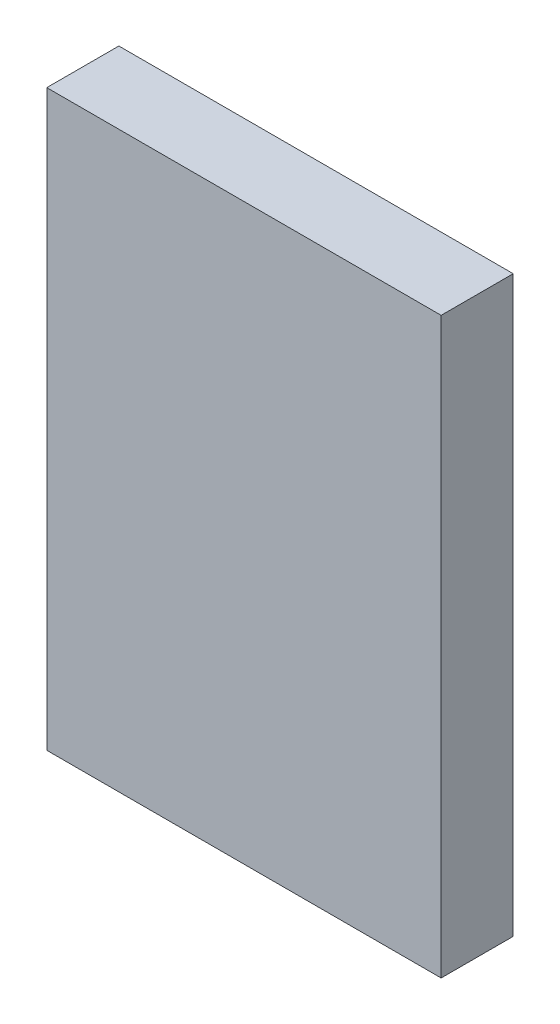
ISO-10303-21;
HEADER;
FILE_DESCRIPTION(('STEP AP214'),'2;1');
FILE_NAME('part.step','',(''),(''),'','','');
FILE_SCHEMA(('AUTOMOTIVE_DESIGN { 1 0 10303 214 1 1 1 1 }'));
ENDSEC;
DATA;
#1=APPLICATION_CONTEXT('core data for automotive mechanical design processes');
#2=APPLICATION_PROTOCOL_DEFINITION('international standard','automotive_design',2000,#1);
#3=PRODUCT_CONTEXT('',#1,'mechanical');
#4=PRODUCT('Part','Part','',(#3));
#5=PRODUCT_RELATED_PRODUCT_CATEGORY('part','',(#4));
#6=PRODUCT_DEFINITION_FORMATION('','',#4);
#7=PRODUCT_DEFINITION_CONTEXT('part definition',#1,'design');
#8=PRODUCT_DEFINITION('design','',#6,#7);
#9=PRODUCT_DEFINITION_SHAPE('','',#8);
#10=(LENGTH_UNIT() NAMED_UNIT(*) SI_UNIT(.MILLI.,.METRE.));
#11=(NAMED_UNIT(*) PLANE_ANGLE_UNIT() SI_UNIT($,.RADIAN.));
#12=(NAMED_UNIT(*) SI_UNIT($,.STERADIAN.) SOLID_ANGLE_UNIT());
#13=UNCERTAINTY_MEASURE_WITH_UNIT(LENGTH_MEASURE(1.E-05),#10,'distance_accuracy_value','');
#14=(GEOMETRIC_REPRESENTATION_CONTEXT(3) GLOBAL_UNCERTAINTY_ASSIGNED_CONTEXT((#13)) GLOBAL_UNIT_ASSIGNED_CONTEXT((#10,
#11,#12)) REPRESENTATION_CONTEXT('',''));
#15=CARTESIAN_POINT('',(0.,0.,0.));
#16=DIRECTION('',(0.,0.,1.));
#17=DIRECTION('',(1.,0.,0.));
#18=AXIS2_PLACEMENT_3D('',#15,#16,#17);
#19=CARTESIAN_POINT('',(-1.054,1.143,0.));
#20=DIRECTION('',(0.,-1.,0.));
#21=DIRECTION('',(0.,0.,-1.));
#22=AXIS2_PLACEMENT_3D('',#19,#20,#21);
#23=PLANE('',#22);
#24=DIRECTION('',(-1.,0.,0.));
#25=VECTOR('',#24,1.);
#26=CARTESIAN_POINT('',(-0.775,1.143,0.));
#27=LINE('',#26,#25);
#28=CARTESIAN_POINT('',(-0.775,1.143,0.));
#29=VERTEX_POINT('',#28);
#30=CARTESIAN_POINT('',(-1.054,1.143,0.));
#31=VERTEX_POINT('',#30);
#32=EDGE_CURVE('E11',#29,#31,#27,.T.);
#33=ORIENTED_EDGE('',*,*,#32,.F.);
#34=DIRECTION('',(0.,0.,-1.));
#35=VECTOR('',#34,1.);
#36=CARTESIAN_POINT('',(-0.775,1.143,0.051));
#37=LINE('',#36,#35);
#38=CARTESIAN_POINT('',(-0.775,1.143,0.051));
#39=VERTEX_POINT('',#38);
#40=EDGE_CURVE('E24',#39,#29,#37,.T.);
#41=ORIENTED_EDGE('',*,*,#40,.F.);
#42=DIRECTION('',(1.,0.,0.));
#43=VECTOR('',#42,1.);
#44=CARTESIAN_POINT('',(-1.054,1.143,0.051));
#45=LINE('',#44,#43);
#46=CARTESIAN_POINT('',(-1.054,1.143,0.051));
#47=VERTEX_POINT('',#46);
#48=EDGE_CURVE('E88',#47,#39,#45,.T.);
#49=ORIENTED_EDGE('',*,*,#48,.F.);
#50=DIRECTION('',(0.,0.,1.));
#51=VECTOR('',#50,1.);
#52=CARTESIAN_POINT('',(-1.054,1.143,0.));
#53=LINE('',#52,#51);
#54=EDGE_CURVE('E77',#31,#47,#53,.T.);
#55=ORIENTED_EDGE('',*,*,#54,.F.);
#56=EDGE_LOOP('',(#33,#41,#49,#55));
#57=FACE_BOUND('',#56,.T.);
#58=ADVANCED_FACE('F17',(#57),#23,.T.);
#59=CARTESIAN_POINT('',(-0.775,1.143,0.));
#60=DIRECTION('',(1.,0.,0.));
#61=DIRECTION('',(0.,1.,0.));
#62=AXIS2_PLACEMENT_3D('',#59,#60,#61);
#63=PLANE('',#62);
#64=DIRECTION('',(0.,-1.,0.));
#65=VECTOR('',#64,1.);
#66=CARTESIAN_POINT('',(-0.775,1.549,0.));
#67=LINE('',#66,#65);
#68=CARTESIAN_POINT('',(-0.775,1.549,0.));
#69=VERTEX_POINT('',#68);
#70=EDGE_CURVE('E85',#69,#29,#67,.T.);
#71=ORIENTED_EDGE('',*,*,#70,.F.);
#72=DIRECTION('',(0.,0.,-1.));
#73=VECTOR('',#72,1.);
#74=CARTESIAN_POINT('',(-0.775,1.549,0.051));
#75=LINE('',#74,#73);
#76=CARTESIAN_POINT('',(-0.775,1.549,0.051));
#77=VERTEX_POINT('',#76);
#78=EDGE_CURVE('E83',#77,#69,#75,.T.);
#79=ORIENTED_EDGE('',*,*,#78,.F.);
#80=DIRECTION('',(0.,1.,0.));
#81=VECTOR('',#80,1.);
#82=CARTESIAN_POINT('',(-0.775,1.143,0.051));
#83=LINE('',#82,#81);
#84=EDGE_CURVE('E72',#39,#77,#83,.T.);
#85=ORIENTED_EDGE('',*,*,#84,.F.);
#86=ORIENTED_EDGE('',*,*,#40,.T.);
#87=EDGE_LOOP('',(#71,#79,#85,#86));
#88=FACE_BOUND('',#87,.T.);
#89=ADVANCED_FACE('F90',(#88),#63,.T.);
#90=CARTESIAN_POINT('',(-0.775,1.549,0.));
#91=DIRECTION('',(0.,1.,0.));
#92=DIRECTION('',(1.,0.,0.));
#93=AXIS2_PLACEMENT_3D('',#90,#91,#92);
#94=PLANE('',#93);
#95=DIRECTION('',(1.,0.,0.));
#96=VECTOR('',#95,1.);
#97=CARTESIAN_POINT('',(-1.054,1.549,0.));
#98=LINE('',#97,#96);
#99=CARTESIAN_POINT('',(-1.054,1.549,0.));
#100=VERTEX_POINT('',#99);
#101=EDGE_CURVE('E60',#100,#69,#98,.T.);
#102=ORIENTED_EDGE('',*,*,#101,.F.);
#103=DIRECTION('',(0.,0.,-1.));
#104=VECTOR('',#103,1.);
#105=CARTESIAN_POINT('',(-1.054,1.549,0.051));
#106=LINE('',#105,#104);
#107=CARTESIAN_POINT('',(-1.054,1.549,0.051));
#108=VERTEX_POINT('',#107);
#109=EDGE_CURVE('E54',#108,#100,#106,.T.);
#110=ORIENTED_EDGE('',*,*,#109,.F.);
#111=DIRECTION('',(-1.,0.,0.));
#112=VECTOR('',#111,1.);
#113=CARTESIAN_POINT('',(-0.775,1.549,0.051));
#114=LINE('',#113,#112);
#115=EDGE_CURVE('E58',#77,#108,#114,.T.);
#116=ORIENTED_EDGE('',*,*,#115,.F.);
#117=ORIENTED_EDGE('',*,*,#78,.T.);
#118=EDGE_LOOP('',(#102,#110,#116,#117));
#119=FACE_BOUND('',#118,.T.);
#120=ADVANCED_FACE('F56',(#119),#94,.T.);
#121=CARTESIAN_POINT('',(-1.054,1.549,0.));
#122=DIRECTION('',(-1.,0.,0.));
#123=DIRECTION('',(0.,0.,1.));
#124=AXIS2_PLACEMENT_3D('',#121,#122,#123);
#125=PLANE('',#124);
#126=DIRECTION('',(0.,1.,0.));
#127=VECTOR('',#126,1.);
#128=CARTESIAN_POINT('',(-1.054,1.143,0.));
#129=LINE('',#128,#127);
#130=EDGE_CURVE('E73',#31,#100,#129,.T.);
#131=ORIENTED_EDGE('',*,*,#130,.F.);
#132=ORIENTED_EDGE('',*,*,#54,.T.);
#133=DIRECTION('',(0.,-1.,0.));
#134=VECTOR('',#133,1.);
#135=CARTESIAN_POINT('',(-1.054,1.549,0.051));
#136=LINE('',#135,#134);
#137=EDGE_CURVE('E70',#108,#47,#136,.T.);
#138=ORIENTED_EDGE('',*,*,#137,.F.);
#139=ORIENTED_EDGE('',*,*,#109,.T.);
#140=EDGE_LOOP('',(#131,#132,#138,#139));
#141=FACE_BOUND('',#140,.T.);
#142=ADVANCED_FACE('F76',(#141),#125,.T.);
#143=CARTESIAN_POINT('',(-1.054,1.549,0.));
#144=DIRECTION('',(0.,0.,-1.));
#145=DIRECTION('',(0.,-1.,0.));
#146=AXIS2_PLACEMENT_3D('',#143,#144,#145);
#147=PLANE('',#146);
#148=ORIENTED_EDGE('',*,*,#101,.T.);
#149=ORIENTED_EDGE('',*,*,#70,.T.);
#150=ORIENTED_EDGE('',*,*,#32,.T.);
#151=ORIENTED_EDGE('',*,*,#130,.T.);
#152=EDGE_LOOP('',(#148,#149,#150,#151));
#153=FACE_BOUND('',#152,.T.);
#154=ADVANCED_FACE('F91',(#153),#147,.T.);
#155=CARTESIAN_POINT('',(-1.054,1.143,0.051));
#156=DIRECTION('',(0.,0.,1.));
#157=DIRECTION('',(1.,0.,0.));
#158=AXIS2_PLACEMENT_3D('',#155,#156,#157);
#159=PLANE('',#158);
#160=ORIENTED_EDGE('',*,*,#48,.T.);
#161=ORIENTED_EDGE('',*,*,#84,.T.);
#162=ORIENTED_EDGE('',*,*,#115,.T.);
#163=ORIENTED_EDGE('',*,*,#137,.T.);
#164=EDGE_LOOP('',(#160,#161,#162,#163));
#165=FACE_BOUND('',#164,.T.);
#166=ADVANCED_FACE('F69',(#165),#159,.T.);
#167=CLOSED_SHELL('',(#58,#89,#120,#142,#154,#166));
#168=MANIFOLD_SOLID_BREP('B1',#167);
#169=ADVANCED_BREP_SHAPE_REPRESENTATION('',(#18,#168),#14);
#170=SHAPE_DEFINITION_REPRESENTATION(#9,#169);
ENDSEC;
END-ISO-10303-21;
